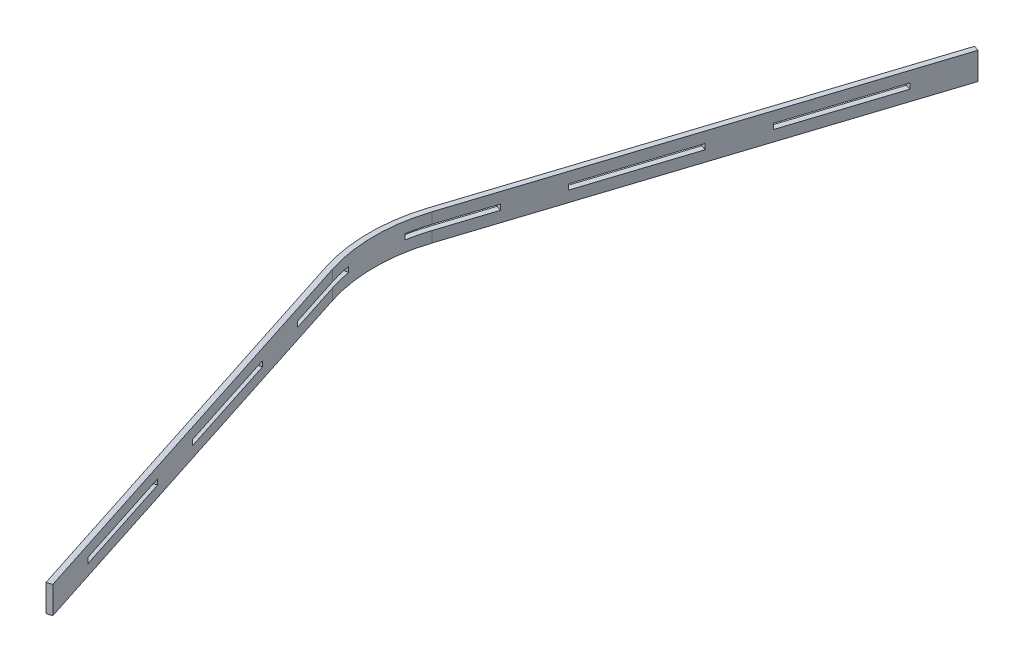
ISO-10303-21;
HEADER;
FILE_DESCRIPTION(('STEP AP214'),'2;1');
FILE_NAME('part.step','',(''),(''),'','','');
FILE_SCHEMA(('AUTOMOTIVE_DESIGN { 1 0 10303 214 1 1 1 1 }'));
ENDSEC;
DATA;
#1=APPLICATION_CONTEXT('core data for automotive mechanical design processes');
#2=APPLICATION_PROTOCOL_DEFINITION('international standard','automotive_design',2000,#1);
#3=PRODUCT_CONTEXT('',#1,'mechanical');
#4=PRODUCT('Part','Part','',(#3));
#5=PRODUCT_RELATED_PRODUCT_CATEGORY('part','',(#4));
#6=PRODUCT_DEFINITION_FORMATION('','',#4);
#7=PRODUCT_DEFINITION_CONTEXT('part definition',#1,'design');
#8=PRODUCT_DEFINITION('design','',#6,#7);
#9=PRODUCT_DEFINITION_SHAPE('','',#8);
#10=(LENGTH_UNIT() NAMED_UNIT(*) SI_UNIT(.MILLI.,.METRE.));
#11=(NAMED_UNIT(*) PLANE_ANGLE_UNIT() SI_UNIT($,.RADIAN.));
#12=(NAMED_UNIT(*) SI_UNIT($,.STERADIAN.) SOLID_ANGLE_UNIT());
#13=UNCERTAINTY_MEASURE_WITH_UNIT(LENGTH_MEASURE(1.E-05),#10,'distance_accuracy_value','');
#14=(GEOMETRIC_REPRESENTATION_CONTEXT(3) GLOBAL_UNCERTAINTY_ASSIGNED_CONTEXT((#13)) GLOBAL_UNIT_ASSIGNED_CONTEXT((#10,
#11,#12)) REPRESENTATION_CONTEXT('',''));
#15=CARTESIAN_POINT('',(0.,0.,0.));
#16=DIRECTION('',(0.,0.,1.));
#17=DIRECTION('',(1.,0.,0.));
#18=AXIS2_PLACEMENT_3D('',#15,#16,#17);
#19=CARTESIAN_POINT('',(0.,5.,0.));
#20=DIRECTION('',(0.,-1.,0.));
#21=DIRECTION('',(0.,0.,-1.));
#22=AXIS2_PLACEMENT_3D('',#19,#20,#21);
#23=PLANE('',#22);
#24=DIRECTION('',(0.306896026451273,0.,-0.951743047754182));
#25=VECTOR('',#24,1.);
#26=CARTESIAN_POINT('',(-40.0060931652364,5.,-853.463246138728));
#27=LINE('',#26,#25);
#28=CARTESIAN_POINT('',(-224.143709036,5.,-282.417417486219));
#29=VERTEX_POINT('',#28);
#30=CARTESIAN_POINT('',(-162.764503745746,5.,-472.766027037055));
#31=VERTEX_POINT('',#30);
#32=EDGE_CURVE('E551',#29,#31,#27,.T.);
#33=ORIENTED_EDGE('',*,*,#32,.F.);
#34=DIRECTION('',(-0.951743047754182,0.,-0.306896026451274));
#35=VECTOR('',#34,1.);
#36=CARTESIAN_POINT('',(-233.661139513542,5.,-285.486377750731));
#37=LINE('',#36,#35);
#38=CARTESIAN_POINT('',(-233.661139513542,5.,-285.486377750731));
#39=VERTEX_POINT('',#38);
#40=EDGE_CURVE('E573',#29,#39,#37,.T.);
#41=ORIENTED_EDGE('',*,*,#40,.T.);
#42=DIRECTION('',(-0.306896026451273,0.,0.951743047754182));
#43=VECTOR('',#42,1.);
#44=CARTESIAN_POINT('',(-49.5235236427783,5.,-856.532206403241));
#45=LINE('',#44,#43);
#46=CARTESIAN_POINT('',(-172.281934223287,5.,-475.834987301568));
#47=VERTEX_POINT('',#46);
#48=EDGE_CURVE('E553',#47,#39,#45,.T.);
#49=ORIENTED_EDGE('',*,*,#48,.F.);
#50=DIRECTION('',(0.951743047754182,0.,0.306896026451274));
#51=VECTOR('',#50,1.);
#52=CARTESIAN_POINT('',(-162.764503745746,5.,-472.766027037055));
#53=LINE('',#52,#51);
#54=EDGE_CURVE('E517',#47,#31,#53,.T.);
#55=ORIENTED_EDGE('',*,*,#54,.T.);
#56=EDGE_LOOP('',(#33,#41,#49,#55));
#57=FACE_BOUND('',#56,.T.);
#58=ADVANCED_FACE('F33',(#57),#23,.T.);
#59=CARTESIAN_POINT('',(-264.350742158669,5.,-190.312072975313));
#60=VERTEX_POINT('',#59);
#61=CARTESIAN_POINT('',(-295.040344803797,5.,-95.1377681998943));
#62=VERTEX_POINT('',#61);
#63=EDGE_CURVE('E550',#60,#62,#45,.T.);
#64=ORIENTED_EDGE('',*,*,#63,.F.);
#65=DIRECTION('',(0.951743047754183,0.,0.306896026451272));
#66=VECTOR('',#65,1.);
#67=CARTESIAN_POINT('',(-264.350742158669,5.,-190.312072975313));
#68=LINE('',#67,#66);
#69=CARTESIAN_POINT('',(-254.833311681128,5.,-187.2431127108));
#70=VERTEX_POINT('',#69);
#71=EDGE_CURVE('E50',#60,#70,#68,.T.);
#72=ORIENTED_EDGE('',*,*,#71,.T.);
#73=CARTESIAN_POINT('',(-285.522914326255,5.,-92.0688079353818));
#74=VERTEX_POINT('',#73);
#75=EDGE_CURVE('E543',#74,#70,#27,.T.);
#76=ORIENTED_EDGE('',*,*,#75,.F.);
#77=CARTESIAN_POINT('',(0.,5.,0.));
#78=DIRECTION('',(0.,-1.,0.));
#79=DIRECTION('',(0.,0.,-1.));
#80=AXIS2_PLACEMENT_3D('',#77,#78,#79);
#81=CIRCLE('',#80,300.);
#82=CARTESIAN_POINT('',(-295.442325903663,5.,-52.0944533000793));
#83=VERTEX_POINT('',#82);
#84=EDGE_CURVE('E533',#83,#74,#81,.T.);
#85=ORIENTED_EDGE('',*,*,#84,.F.);
#86=DIRECTION('',(-0.984807753012208,0.,-0.173648177666931));
#87=VECTOR('',#86,1.);
#88=CARTESIAN_POINT('',(-305.290403433784,5.,-53.8309350767487));
#89=LINE('',#88,#87);
#90=CARTESIAN_POINT('',(-305.290403433784,5.,-53.8309350767487));
#91=VERTEX_POINT('',#90);
#92=EDGE_CURVE('E348',#83,#91,#89,.T.);
#93=ORIENTED_EDGE('',*,*,#92,.T.);
#94=CARTESIAN_POINT('',(0.,5.,0.));
#95=DIRECTION('',(0.,1.,0.));
#96=DIRECTION('',(0.,0.,-1.));
#97=AXIS2_PLACEMENT_3D('',#94,#95,#96);
#98=CIRCLE('',#97,310.);
#99=EDGE_CURVE('E455',#62,#91,#98,.T.);
#100=ORIENTED_EDGE('',*,*,#99,.F.);
#101=EDGE_LOOP('',(#64,#72,#76,#85,#93,#100));
#102=FACE_BOUND('',#101,.T.);
#103=ADVANCED_FACE('F549',(#102),#23,.T.);
#104=CARTESIAN_POINT('',(-80.2131262879055,5.,-761.357901627822));
#105=VERTEX_POINT('',#104);
#106=CARTESIAN_POINT('',(-141.59233157816,5.,-571.009292076986));
#107=VERTEX_POINT('',#106);
#108=EDGE_CURVE('E554',#105,#107,#45,.T.);
#109=ORIENTED_EDGE('',*,*,#108,.F.);
#110=DIRECTION('',(0.951743047754182,0.,0.306896026451273));
#111=VECTOR('',#110,1.);
#112=CARTESIAN_POINT('',(-70.6956958103637,5.,-758.28894136331));
#113=LINE('',#112,#111);
#114=CARTESIAN_POINT('',(-70.6956958103637,5.,-758.28894136331));
#115=VERTEX_POINT('',#114);
#116=EDGE_CURVE('E58',#105,#115,#113,.T.);
#117=ORIENTED_EDGE('',*,*,#116,.T.);
#118=CARTESIAN_POINT('',(-132.074901100618,5.,-567.940331812473));
#119=VERTEX_POINT('',#118);
#120=EDGE_CURVE('E552',#119,#115,#27,.T.);
#121=ORIENTED_EDGE('',*,*,#120,.F.);
#122=DIRECTION('',(-0.951743047754185,0.,-0.306896026451265));
#123=VECTOR('',#122,1.);
#124=CARTESIAN_POINT('',(-132.074901100618,5.,-567.940331812473));
#125=LINE('',#124,#123);
#126=EDGE_CURVE('E595',#119,#107,#125,.T.);
#127=ORIENTED_EDGE('',*,*,#126,.T.);
#128=EDGE_LOOP('',(#109,#117,#121,#127));
#129=FACE_BOUND('',#128,.T.);
#130=ADVANCED_FACE('F609',(#129),#23,.T.);
#131=CARTESIAN_POINT('',(-305.290403433784,5.,53.8309350767487));
#132=VERTEX_POINT('',#131);
#133=CARTESIAN_POINT('',(-295.040344803796,5.,95.1377681998945));
#134=VERTEX_POINT('',#133);
#135=EDGE_CURVE('E477',#132,#134,#98,.T.);
#136=ORIENTED_EDGE('',*,*,#135,.F.);
#137=DIRECTION('',(0.984807753012208,0.,-0.173648177666931));
#138=VECTOR('',#137,1.);
#139=CARTESIAN_POINT('',(-305.290403433784,5.,53.8309350767487));
#140=LINE('',#139,#138);
#141=CARTESIAN_POINT('',(-295.442325903663,5.,52.0944533000794));
#142=VERTEX_POINT('',#141);
#143=EDGE_CURVE('E344',#132,#142,#140,.T.);
#144=ORIENTED_EDGE('',*,*,#143,.T.);
#145=CARTESIAN_POINT('',(-285.522914326255,5.,92.0688079353817));
#146=VERTEX_POINT('',#145);
#147=EDGE_CURVE('E436',#146,#142,#81,.T.);
#148=ORIENTED_EDGE('',*,*,#147,.F.);
#149=DIRECTION('',(-0.306896026451273,0.,-0.951743047754182));
#150=VECTOR('',#149,1.);
#151=CARTESIAN_POINT('',(-40.0060931652364,5.,853.463246138728));
#152=LINE('',#151,#150);
#153=CARTESIAN_POINT('',(-254.833311681127,5.,187.243112710801));
#154=VERTEX_POINT('',#153);
#155=EDGE_CURVE('E413',#154,#146,#152,.T.);
#156=ORIENTED_EDGE('',*,*,#155,.F.);
#157=DIRECTION('',(-0.951743047754183,0.,0.306896026451272));
#158=VECTOR('',#157,1.);
#159=CARTESIAN_POINT('',(-264.350742158669,5.,190.312072975313));
#160=LINE('',#159,#158);
#161=CARTESIAN_POINT('',(-264.350742158669,5.,190.312072975313));
#162=VERTEX_POINT('',#161);
#163=EDGE_CURVE('E368',#154,#162,#160,.T.);
#164=ORIENTED_EDGE('',*,*,#163,.T.);
#165=DIRECTION('',(0.306896026451273,0.,0.951743047754182));
#166=VECTOR('',#165,1.);
#167=CARTESIAN_POINT('',(-49.5235236427783,5.,856.532206403241));
#168=LINE('',#167,#166);
#169=EDGE_CURVE('E418',#134,#162,#168,.T.);
#170=ORIENTED_EDGE('',*,*,#169,.F.);
#171=EDGE_LOOP('',(#136,#144,#148,#156,#164,#170));
#172=FACE_BOUND('',#171,.T.);
#173=ADVANCED_FACE('F564',(#172),#23,.T.);
#174=CARTESIAN_POINT('',(-233.661139513542,5.,285.486377750731));
#175=VERTEX_POINT('',#174);
#176=CARTESIAN_POINT('',(-172.281934223287,5.,475.834987301568));
#177=VERTEX_POINT('',#176);
#178=EDGE_CURVE('E454',#175,#177,#168,.T.);
#179=ORIENTED_EDGE('',*,*,#178,.F.);
#180=DIRECTION('',(0.951743047754182,0.,-0.306896026451274));
#181=VECTOR('',#180,1.);
#182=CARTESIAN_POINT('',(-233.661139513542,5.,285.486377750731));
#183=LINE('',#182,#181);
#184=CARTESIAN_POINT('',(-224.143709036,5.,282.417417486219));
#185=VERTEX_POINT('',#184);
#186=EDGE_CURVE('E365',#175,#185,#183,.T.);
#187=ORIENTED_EDGE('',*,*,#186,.T.);
#188=CARTESIAN_POINT('',(-162.764503745746,5.,472.766027037055));
#189=VERTEX_POINT('',#188);
#190=EDGE_CURVE('E446',#189,#185,#152,.T.);
#191=ORIENTED_EDGE('',*,*,#190,.F.);
#192=DIRECTION('',(-0.951743047754182,0.,0.306896026451274));
#193=VECTOR('',#192,1.);
#194=CARTESIAN_POINT('',(-162.764503745746,5.,472.766027037055));
#195=LINE('',#194,#193);
#196=EDGE_CURVE('E390',#189,#177,#195,.T.);
#197=ORIENTED_EDGE('',*,*,#196,.T.);
#198=EDGE_LOOP('',(#179,#187,#191,#197));
#199=FACE_BOUND('',#198,.T.);
#200=ADVANCED_FACE('F616',(#199),#23,.T.);
#201=CARTESIAN_POINT('',(-141.59233157816,5.,571.009292076986));
#202=VERTEX_POINT('',#201);
#203=CARTESIAN_POINT('',(-80.2131262879055,5.,761.357901627822));
#204=VERTEX_POINT('',#203);
#205=EDGE_CURVE('E452',#202,#204,#168,.T.);
#206=ORIENTED_EDGE('',*,*,#205,.F.);
#207=DIRECTION('',(0.951743047754184,0.,-0.306896026451267));
#208=VECTOR('',#207,1.);
#209=CARTESIAN_POINT('',(-132.074901100618,5.,567.940331812473));
#210=LINE('',#209,#208);
#211=CARTESIAN_POINT('',(-132.074901100618,5.,567.940331812473));
#212=VERTEX_POINT('',#211);
#213=EDGE_CURVE('E393',#202,#212,#210,.T.);
#214=ORIENTED_EDGE('',*,*,#213,.T.);
#215=CARTESIAN_POINT('',(-70.6956958103637,5.,758.28894136331));
#216=VERTEX_POINT('',#215);
#217=EDGE_CURVE('E441',#216,#212,#152,.T.);
#218=ORIENTED_EDGE('',*,*,#217,.F.);
#219=DIRECTION('',(-0.951743047754182,0.,0.306896026451273));
#220=VECTOR('',#219,1.);
#221=CARTESIAN_POINT('',(-70.6956958103637,5.,758.28894136331));
#222=LINE('',#221,#220);
#223=EDGE_CURVE('E656',#216,#204,#222,.T.);
#224=ORIENTED_EDGE('',*,*,#223,.T.);
#225=EDGE_LOOP('',(#206,#214,#218,#224));
#226=FACE_BOUND('',#225,.T.);
#227=ADVANCED_FACE('F617',(#226),#23,.T.);
#228=CARTESIAN_POINT('',(-80.2131262879056,5.,761.357901627822));
#229=DIRECTION('',(0.951743047754182,0.,-0.306896026451273));
#230=DIRECTION('',(-0.306896026451273,0.,-0.951743047754182));
#231=AXIS2_PLACEMENT_3D('',#228,#229,#230);
#232=PLANE('',#231);
#233=DIRECTION('',(-0.306896026451273,0.,-0.951743047754182));
#234=VECTOR('',#233,1.);
#235=CARTESIAN_POINT('',(-295.040344803797,-25.,95.1377681998946));
#236=LINE('',#235,#234);
#237=CARTESIAN_POINT('',(-49.5235236427783,-25.,856.532206403241));
#238=VERTEX_POINT('',#237);
#239=CARTESIAN_POINT('',(-295.040344803797,-25.,95.1377681998944));
#240=VERTEX_POINT('',#239);
#241=EDGE_CURVE('E282',#238,#240,#236,.T.);
#242=ORIENTED_EDGE('',*,*,#241,.F.);
#243=DIRECTION('',(0.,-1.,0.));
#244=VECTOR('',#243,1.);
#245=CARTESIAN_POINT('',(-49.5235236427783,5.,856.532206403241));
#246=LINE('',#245,#244);
#247=CARTESIAN_POINT('',(-49.5235236427783,25.,856.532206403241));
#248=VERTEX_POINT('',#247);
#249=EDGE_CURVE('E11',#248,#238,#246,.T.);
#250=ORIENTED_EDGE('',*,*,#249,.F.);
#251=DIRECTION('',(0.306896026451273,0.,0.951743047754182));
#252=VECTOR('',#251,1.);
#253=CARTESIAN_POINT('',(-49.5235236427783,25.,856.532206403241));
#254=LINE('',#253,#252);
#255=CARTESIAN_POINT('',(-295.040344803796,25.,95.1377681998945));
#256=VERTEX_POINT('',#255);
#257=EDGE_CURVE('E430',#256,#248,#254,.T.);
#258=ORIENTED_EDGE('',*,*,#257,.F.);
#259=DIRECTION('',(0.,-1.,0.));
#260=VECTOR('',#259,1.);
#261=CARTESIAN_POINT('',(-295.040344803796,25.,95.1377681998945));
#262=LINE('',#261,#260);
#263=EDGE_CURVE('E433',#256,#134,#262,.T.);
#264=ORIENTED_EDGE('',*,*,#263,.T.);
#265=ORIENTED_EDGE('',*,*,#169,.T.);
#266=DIRECTION('',(0.,-1.,0.));
#267=VECTOR('',#266,1.);
#268=CARTESIAN_POINT('',(-264.350742158669,5.,190.312072975313));
#269=LINE('',#268,#267);
#270=CARTESIAN_POINT('',(-264.350742158669,-5.,190.312072975313));
#271=VERTEX_POINT('',#270);
#272=EDGE_CURVE('E372',#162,#271,#269,.T.);
#273=ORIENTED_EDGE('',*,*,#272,.T.);
#274=DIRECTION('',(-0.306896026451273,0.,-0.951743047754182));
#275=VECTOR('',#274,1.);
#276=CARTESIAN_POINT('',(-295.040344803797,-5.,95.1377681998946));
#277=LINE('',#276,#275);
#278=CARTESIAN_POINT('',(-295.040344803797,-5.,95.1377681998944));
#279=VERTEX_POINT('',#278);
#280=EDGE_CURVE('E295',#271,#279,#277,.T.);
#281=ORIENTED_EDGE('',*,*,#280,.T.);
#282=DIRECTION('',(0.,1.,0.));
#283=VECTOR('',#282,1.);
#284=CARTESIAN_POINT('',(-295.040344803797,-25.,95.1377681998944));
#285=LINE('',#284,#283);
#286=EDGE_CURVE('E275',#240,#279,#285,.T.);
#287=ORIENTED_EDGE('',*,*,#286,.F.);
#288=EDGE_LOOP('',(#242,#250,#258,#264,#265,#273,#281,#287));
#289=FACE_BOUND('',#288,.T.);
#290=CARTESIAN_POINT('',(-80.2131262879056,-5.,761.357901627822));
#291=VERTEX_POINT('',#290);
#292=CARTESIAN_POINT('',(-141.59233157816,-5.,571.009292076986));
#293=VERTEX_POINT('',#292);
#294=EDGE_CURVE('E485',#291,#293,#277,.T.);
#295=ORIENTED_EDGE('',*,*,#294,.T.);
#296=DIRECTION('',(0.,-1.,0.));
#297=VECTOR('',#296,1.);
#298=CARTESIAN_POINT('',(-141.59233157816,5.,571.009292076986));
#299=LINE('',#298,#297);
#300=EDGE_CURVE('E404',#202,#293,#299,.T.);
#301=ORIENTED_EDGE('',*,*,#300,.F.);
#302=ORIENTED_EDGE('',*,*,#205,.T.);
#303=DIRECTION('',(0.,-1.,0.));
#304=VECTOR('',#303,1.);
#305=CARTESIAN_POINT('',(-80.2131262879056,5.,761.357901627822));
#306=LINE('',#305,#304);
#307=EDGE_CURVE('E646',#204,#291,#306,.T.);
#308=ORIENTED_EDGE('',*,*,#307,.T.);
#309=EDGE_LOOP('',(#295,#301,#302,#308));
#310=FACE_BOUND('',#309,.T.);
#311=DIRECTION('',(0.,-1.,0.));
#312=VECTOR('',#311,1.);
#313=CARTESIAN_POINT('',(-172.281934223287,5.,475.834987301568));
#314=LINE('',#313,#312);
#315=CARTESIAN_POINT('',(-172.281934223287,-5.,475.834987301568));
#316=VERTEX_POINT('',#315);
#317=EDGE_CURVE('E407',#177,#316,#314,.T.);
#318=ORIENTED_EDGE('',*,*,#317,.T.);
#319=CARTESIAN_POINT('',(-233.661139513542,-5.,285.486377750731));
#320=VERTEX_POINT('',#319);
#321=EDGE_CURVE('E641',#316,#320,#277,.T.);
#322=ORIENTED_EDGE('',*,*,#321,.T.);
#323=DIRECTION('',(0.,-1.,0.));
#324=VECTOR('',#323,1.);
#325=CARTESIAN_POINT('',(-233.661139513542,5.,285.486377750731));
#326=LINE('',#325,#324);
#327=EDGE_CURVE('E386',#175,#320,#326,.T.);
#328=ORIENTED_EDGE('',*,*,#327,.F.);
#329=ORIENTED_EDGE('',*,*,#178,.T.);
#330=EDGE_LOOP('',(#318,#322,#328,#329));
#331=FACE_BOUND('',#330,.T.);
#332=ADVANCED_FACE('F35',(#289,#310,#331),#232,.F.);
#333=CARTESIAN_POINT('',(-49.5235236427783,5.,856.532206403241));
#334=DIRECTION('',(-0.306896026451275,0.,-0.951743047754182));
#335=DIRECTION('',(-0.951743047754182,0.,0.306896026451275));
#336=AXIS2_PLACEMENT_3D('',#333,#334,#335);
#337=PLANE('',#336);
#338=ORIENTED_EDGE('',*,*,#249,.T.);
#339=DIRECTION('',(-0.951743047754182,0.,0.306896026451275));
#340=VECTOR('',#339,1.);
#341=CARTESIAN_POINT('',(-49.5235236427783,-25.,856.532206403241));
#342=LINE('',#341,#340);
#343=CARTESIAN_POINT('',(-40.0060931652364,-25.,853.463246138728));
#344=VERTEX_POINT('',#343);
#345=EDGE_CURVE('E289',#344,#238,#342,.T.);
#346=ORIENTED_EDGE('',*,*,#345,.F.);
#347=DIRECTION('',(0.,-1.,0.));
#348=VECTOR('',#347,1.);
#349=CARTESIAN_POINT('',(-40.0060931652364,5.,853.463246138728));
#350=LINE('',#349,#348);
#351=CARTESIAN_POINT('',(-40.0060931652364,25.,853.463246138728));
#352=VERTEX_POINT('',#351);
#353=EDGE_CURVE('E42',#352,#344,#350,.T.);
#354=ORIENTED_EDGE('',*,*,#353,.F.);
#355=DIRECTION('',(0.951743047754182,0.,-0.306896026451275));
#356=VECTOR('',#355,1.);
#357=CARTESIAN_POINT('',(-49.5235236427783,25.,856.532206403241));
#358=LINE('',#357,#356);
#359=EDGE_CURVE('E414',#248,#352,#358,.T.);
#360=ORIENTED_EDGE('',*,*,#359,.F.);
#361=EDGE_LOOP('',(#338,#346,#354,#360));
#362=FACE_BOUND('',#361,.T.);
#363=ADVANCED_FACE('F677',(#362),#337,.F.);
#364=CARTESIAN_POINT('',(-70.6956958103637,5.,758.28894136331));
#365=DIRECTION('',(-0.951743047754182,0.,0.306896026451272));
#366=DIRECTION('',(0.306896026451272,0.,0.951743047754183));
#367=AXIS2_PLACEMENT_3D('',#364,#365,#366);
#368=PLANE('',#367);
#369=DIRECTION('',(0.306896026451273,0.,0.951743047754182));
#370=VECTOR('',#369,1.);
#371=CARTESIAN_POINT('',(-40.0060931652364,-5.,853.463246138728));
#372=LINE('',#371,#370);
#373=CARTESIAN_POINT('',(-132.074901100618,-5.,567.940331812473));
#374=VERTEX_POINT('',#373);
#375=CARTESIAN_POINT('',(-70.6956958103637,-5.,758.28894136331));
#376=VERTEX_POINT('',#375);
#377=EDGE_CURVE('E310',#374,#376,#372,.T.);
#378=ORIENTED_EDGE('',*,*,#377,.T.);
#379=DIRECTION('',(0.,-1.,0.));
#380=VECTOR('',#379,1.);
#381=CARTESIAN_POINT('',(-70.6956958103637,5.,758.28894136331));
#382=LINE('',#381,#380);
#383=EDGE_CURVE('E661',#216,#376,#382,.T.);
#384=ORIENTED_EDGE('',*,*,#383,.F.);
#385=ORIENTED_EDGE('',*,*,#217,.T.);
#386=DIRECTION('',(0.,-1.,0.));
#387=VECTOR('',#386,1.);
#388=CARTESIAN_POINT('',(-132.074901100618,5.,567.940331812473));
#389=LINE('',#388,#387);
#390=EDGE_CURVE('E397',#212,#374,#389,.T.);
#391=ORIENTED_EDGE('',*,*,#390,.T.);
#392=EDGE_LOOP('',(#378,#384,#385,#391));
#393=FACE_BOUND('',#392,.T.);
#394=CARTESIAN_POINT('',(-224.143709036,-5.,282.417417486218));
#395=VERTEX_POINT('',#394);
#396=CARTESIAN_POINT('',(-162.764503745746,-5.,472.766027037055));
#397=VERTEX_POINT('',#396);
#398=EDGE_CURVE('E320',#395,#397,#372,.T.);
#399=ORIENTED_EDGE('',*,*,#398,.T.);
#400=DIRECTION('',(0.,-1.,0.));
#401=VECTOR('',#400,1.);
#402=CARTESIAN_POINT('',(-162.764503745746,5.,472.766027037055));
#403=LINE('',#402,#401);
#404=EDGE_CURVE('E410',#189,#397,#403,.T.);
#405=ORIENTED_EDGE('',*,*,#404,.F.);
#406=ORIENTED_EDGE('',*,*,#190,.T.);
#407=DIRECTION('',(0.,-1.,0.));
#408=VECTOR('',#407,1.);
#409=CARTESIAN_POINT('',(-224.143709036,5.,282.417417486219));
#410=LINE('',#409,#408);
#411=EDGE_CURVE('E383',#185,#395,#410,.T.);
#412=ORIENTED_EDGE('',*,*,#411,.T.);
#413=EDGE_LOOP('',(#399,#405,#406,#412));
#414=FACE_BOUND('',#413,.T.);
#415=ORIENTED_EDGE('',*,*,#353,.T.);
#416=DIRECTION('',(0.306896026451273,0.,0.951743047754182));
#417=VECTOR('',#416,1.);
#418=CARTESIAN_POINT('',(-40.0060931652364,-25.,853.463246138728));
#419=LINE('',#418,#417);
#420=CARTESIAN_POINT('',(-285.522914326255,-25.,92.0688079353817));
#421=VERTEX_POINT('',#420);
#422=EDGE_CURVE('E673',#421,#344,#419,.T.);
#423=ORIENTED_EDGE('',*,*,#422,.F.);
#424=DIRECTION('',(0.,1.,0.));
#425=VECTOR('',#424,1.);
#426=CARTESIAN_POINT('',(-285.522914326255,-25.,92.0688079353817));
#427=LINE('',#426,#425);
#428=CARTESIAN_POINT('',(-285.522914326255,-5.,92.0688079353817));
#429=VERTEX_POINT('',#428);
#430=EDGE_CURVE('E321',#421,#429,#427,.T.);
#431=ORIENTED_EDGE('',*,*,#430,.T.);
#432=CARTESIAN_POINT('',(-254.833311681128,-5.,187.2431127108));
#433=VERTEX_POINT('',#432);
#434=EDGE_CURVE('E291',#429,#433,#372,.T.);
#435=ORIENTED_EDGE('',*,*,#434,.T.);
#436=DIRECTION('',(0.,-1.,0.));
#437=VECTOR('',#436,1.);
#438=CARTESIAN_POINT('',(-254.833311681128,5.,187.2431127108));
#439=LINE('',#438,#437);
#440=EDGE_CURVE('E380',#154,#433,#439,.T.);
#441=ORIENTED_EDGE('',*,*,#440,.F.);
#442=ORIENTED_EDGE('',*,*,#155,.T.);
#443=DIRECTION('',(0.,-1.,0.));
#444=VECTOR('',#443,1.);
#445=CARTESIAN_POINT('',(-285.522914326255,25.,92.0688079353817));
#446=LINE('',#445,#444);
#447=CARTESIAN_POINT('',(-285.522914326255,25.,92.0688079353817));
#448=VERTEX_POINT('',#447);
#449=EDGE_CURVE('E545',#448,#146,#446,.T.);
#450=ORIENTED_EDGE('',*,*,#449,.F.);
#451=DIRECTION('',(-0.306896026451273,0.,-0.951743047754182));
#452=VECTOR('',#451,1.);
#453=CARTESIAN_POINT('',(-40.0060931652364,25.,853.463246138728));
#454=LINE('',#453,#452);
#455=EDGE_CURVE('E417',#352,#448,#454,.T.);
#456=ORIENTED_EDGE('',*,*,#455,.F.);
#457=EDGE_LOOP('',(#415,#423,#431,#435,#441,#442,#450,#456));
#458=FACE_BOUND('',#457,.T.);
#459=ADVANCED_FACE('F672',(#393,#414,#458),#368,.F.);
#460=CARTESIAN_POINT('',(-70.6956958103637,5.,758.28894136331));
#461=DIRECTION('',(0.306896026451273,0.,0.951743047754182));
#462=DIRECTION('',(0.951743047754182,0.,-0.306896026451273));
#463=AXIS2_PLACEMENT_3D('',#460,#461,#462);
#464=PLANE('',#463);
#465=DIRECTION('',(-0.951743047754182,0.,0.306896026451273));
#466=VECTOR('',#465,1.);
#467=CARTESIAN_POINT('',(-70.6956958103637,-5.,758.28894136331));
#468=LINE('',#467,#466);
#469=EDGE_CURVE('E660',#376,#291,#468,.T.);
#470=ORIENTED_EDGE('',*,*,#469,.T.);
#471=ORIENTED_EDGE('',*,*,#307,.F.);
#472=ORIENTED_EDGE('',*,*,#223,.F.);
#473=ORIENTED_EDGE('',*,*,#383,.T.);
#474=EDGE_LOOP('',(#470,#471,#472,#473));
#475=FACE_BOUND('',#474,.T.);
#476=ADVANCED_FACE('F658',(#475),#464,.F.);
#477=CARTESIAN_POINT('',(0.,25.,0.));
#478=DIRECTION('',(0.,-1.,0.));
#479=DIRECTION('',(0.,0.,-1.));
#480=AXIS2_PLACEMENT_3D('',#477,#478,#479);
#481=CYLINDRICAL_SURFACE('',#480,300.);
#482=ORIENTED_EDGE('',*,*,#147,.T.);
#483=DIRECTION('',(0.,-1.,0.));
#484=VECTOR('',#483,1.);
#485=CARTESIAN_POINT('',(-295.442325903663,5.,52.0944533000794));
#486=LINE('',#485,#484);
#487=CARTESIAN_POINT('',(-295.442325903663,-5.,52.0944533000794));
#488=VERTEX_POINT('',#487);
#489=EDGE_CURVE('E466',#142,#488,#486,.T.);
#490=ORIENTED_EDGE('',*,*,#489,.T.);
#491=CARTESIAN_POINT('',(0.,-5.,0.));
#492=DIRECTION('',(0.,1.,0.));
#493=DIRECTION('',(0.,0.,1.));
#494=AXIS2_PLACEMENT_3D('',#491,#492,#493);
#495=CIRCLE('',#494,300.);
#496=EDGE_CURVE('E311',#488,#429,#495,.T.);
#497=ORIENTED_EDGE('',*,*,#496,.T.);
#498=ORIENTED_EDGE('',*,*,#430,.F.);
#499=CARTESIAN_POINT('',(0.,-25.,0.));
#500=DIRECTION('',(0.,1.,0.));
#501=DIRECTION('',(0.,0.,1.));
#502=AXIS2_PLACEMENT_3D('',#499,#500,#501);
#503=CIRCLE('',#502,300.);
#504=CARTESIAN_POINT('',(-285.522914326255,-25.,-92.0688079353817));
#505=VERTEX_POINT('',#504);
#506=EDGE_CURVE('E332',#505,#421,#503,.T.);
#507=ORIENTED_EDGE('',*,*,#506,.F.);
#508=DIRECTION('',(0.,1.,0.));
#509=VECTOR('',#508,1.);
#510=CARTESIAN_POINT('',(-285.522914326255,-25.,-92.0688079353817));
#511=LINE('',#510,#509);
#512=CARTESIAN_POINT('',(-285.522914326255,-5.,-92.0688079353817));
#513=VERTEX_POINT('',#512);
#514=EDGE_CURVE('E302',#505,#513,#511,.T.);
#515=ORIENTED_EDGE('',*,*,#514,.T.);
#516=CARTESIAN_POINT('',(-295.442325903662,-5.,-52.0944533000794));
#517=VERTEX_POINT('',#516);
#518=EDGE_CURVE('E306',#513,#517,#495,.T.);
#519=ORIENTED_EDGE('',*,*,#518,.T.);
#520=DIRECTION('',(0.,-1.,0.));
#521=VECTOR('',#520,1.);
#522=CARTESIAN_POINT('',(-295.442325903663,5.,-52.0944533000793));
#523=LINE('',#522,#521);
#524=EDGE_CURVE('E469',#83,#517,#523,.T.);
#525=ORIENTED_EDGE('',*,*,#524,.F.);
#526=ORIENTED_EDGE('',*,*,#84,.T.);
#527=DIRECTION('',(0.,-1.,0.));
#528=VECTOR('',#527,1.);
#529=CARTESIAN_POINT('',(-285.522914326255,25.,-92.0688079353818));
#530=LINE('',#529,#528);
#531=CARTESIAN_POINT('',(-285.522914326255,25.,-92.0688079353818));
#532=VERTEX_POINT('',#531);
#533=EDGE_CURVE('E536',#532,#74,#530,.T.);
#534=ORIENTED_EDGE('',*,*,#533,.F.);
#535=CARTESIAN_POINT('',(0.,25.,0.));
#536=DIRECTION('',(0.,-1.,0.));
#537=DIRECTION('',(0.,0.,-1.));
#538=AXIS2_PLACEMENT_3D('',#535,#536,#537);
#539=CIRCLE('',#538,300.);
#540=EDGE_CURVE('E420',#448,#532,#539,.T.);
#541=ORIENTED_EDGE('',*,*,#540,.F.);
#542=ORIENTED_EDGE('',*,*,#449,.T.);
#543=EDGE_LOOP('',(#482,#490,#497,#498,#507,#515,#519,#525,#526,#534,#541,#542));
#544=FACE_BOUND('',#543,.T.);
#545=ADVANCED_FACE('F329',(#544),#481,.F.);
#546=CARTESIAN_POINT('',(-40.0060931652364,25.,-853.463246138728));
#547=DIRECTION('',(-0.951743047754182,0.,-0.306896026451273));
#548=DIRECTION('',(-0.306896026451273,0.,0.951743047754182));
#549=AXIS2_PLACEMENT_3D('',#546,#547,#548);
#550=PLANE('',#549);
#551=DIRECTION('',(-0.306896026451273,0.,0.951743047754182));
#552=VECTOR('',#551,1.);
#553=CARTESIAN_POINT('',(-40.0060931652364,-5.,-853.463246138728));
#554=LINE('',#553,#552);
#555=CARTESIAN_POINT('',(-70.6956958103637,-5.,-758.28894136331));
#556=VERTEX_POINT('',#555);
#557=CARTESIAN_POINT('',(-132.074901100618,-5.,-567.940331812473));
#558=VERTEX_POINT('',#557);
#559=EDGE_CURVE('E496',#556,#558,#554,.T.);
#560=ORIENTED_EDGE('',*,*,#559,.T.);
#561=DIRECTION('',(0.,-1.,0.));
#562=VECTOR('',#561,1.);
#563=CARTESIAN_POINT('',(-132.074901100618,5.,-567.940331812473));
#564=LINE('',#563,#562);
#565=EDGE_CURVE('E522',#119,#558,#564,.T.);
#566=ORIENTED_EDGE('',*,*,#565,.F.);
#567=ORIENTED_EDGE('',*,*,#120,.T.);
#568=DIRECTION('',(0.,-1.,0.));
#569=VECTOR('',#568,1.);
#570=CARTESIAN_POINT('',(-70.6956958103637,5.,-758.28894136331));
#571=LINE('',#570,#569);
#572=EDGE_CURVE('E592',#115,#556,#571,.T.);
#573=ORIENTED_EDGE('',*,*,#572,.T.);
#574=EDGE_LOOP('',(#560,#566,#567,#573));
#575=FACE_BOUND('',#574,.T.);
#576=DIRECTION('',(-0.306896026451273,0.,0.951743047754182));
#577=VECTOR('',#576,1.);
#578=CARTESIAN_POINT('',(-40.0060931652364,-25.,-853.463246138728));
#579=LINE('',#578,#577);
#580=CARTESIAN_POINT('',(-40.0060931652364,-25.,-853.463246138728));
#581=VERTEX_POINT('',#580);
#582=EDGE_CURVE('E680',#581,#505,#579,.T.);
#583=ORIENTED_EDGE('',*,*,#582,.F.);
#584=DIRECTION('',(0.,-1.,0.));
#585=VECTOR('',#584,1.);
#586=CARTESIAN_POINT('',(-40.0060931652364,25.,-853.463246138728));
#587=LINE('',#586,#585);
#588=CARTESIAN_POINT('',(-40.0060931652364,25.,-853.463246138728));
#589=VERTEX_POINT('',#588);
#590=EDGE_CURVE('E546',#589,#581,#587,.T.);
#591=ORIENTED_EDGE('',*,*,#590,.F.);
#592=DIRECTION('',(0.306896026451273,0.,-0.951743047754182));
#593=VECTOR('',#592,1.);
#594=CARTESIAN_POINT('',(-40.0060931652364,25.,-853.463246138728));
#595=LINE('',#594,#593);
#596=EDGE_CURVE('E422',#532,#589,#595,.T.);
#597=ORIENTED_EDGE('',*,*,#596,.F.);
#598=ORIENTED_EDGE('',*,*,#533,.T.);
#599=ORIENTED_EDGE('',*,*,#75,.T.);
#600=DIRECTION('',(0.,-1.,0.));
#601=VECTOR('',#600,1.);
#602=CARTESIAN_POINT('',(-254.833311681128,5.,-187.2431127108));
#603=LINE('',#602,#601);
#604=CARTESIAN_POINT('',(-254.833311681127,-5.,-187.243112710801));
#605=VERTEX_POINT('',#604);
#606=EDGE_CURVE('E581',#70,#605,#603,.T.);
#607=ORIENTED_EDGE('',*,*,#606,.T.);
#608=EDGE_CURVE('E316',#605,#513,#554,.T.);
#609=ORIENTED_EDGE('',*,*,#608,.T.);
#610=ORIENTED_EDGE('',*,*,#514,.F.);
#611=EDGE_LOOP('',(#583,#591,#597,#598,#599,#607,#609,#610));
#612=FACE_BOUND('',#611,.T.);
#613=DIRECTION('',(0.,-1.,0.));
#614=VECTOR('',#613,1.);
#615=CARTESIAN_POINT('',(-162.764503745746,5.,-472.766027037055));
#616=LINE('',#615,#614);
#617=CARTESIAN_POINT('',(-162.764503745745,-5.,-472.766027037055));
#618=VERTEX_POINT('',#617);
#619=EDGE_CURVE('E518',#31,#618,#616,.T.);
#620=ORIENTED_EDGE('',*,*,#619,.T.);
#621=CARTESIAN_POINT('',(-224.143709036,-5.,-282.417417486219));
#622=VERTEX_POINT('',#621);
#623=EDGE_CURVE('E495',#618,#622,#554,.T.);
#624=ORIENTED_EDGE('',*,*,#623,.T.);
#625=DIRECTION('',(0.,-1.,0.));
#626=VECTOR('',#625,1.);
#627=CARTESIAN_POINT('',(-224.143709036,5.,-282.417417486219));
#628=LINE('',#627,#626);
#629=EDGE_CURVE('E576',#29,#622,#628,.T.);
#630=ORIENTED_EDGE('',*,*,#629,.F.);
#631=ORIENTED_EDGE('',*,*,#32,.T.);
#632=EDGE_LOOP('',(#620,#624,#630,#631));
#633=FACE_BOUND('',#632,.T.);
#634=ADVANCED_FACE('F540',(#575,#612,#633),#550,.F.);
#635=CARTESIAN_POINT('',(-49.5235236427783,25.,-856.532206403241));
#636=DIRECTION('',(-0.306896026451275,0.,0.951743047754182));
#637=DIRECTION('',(0.951743047754182,0.,0.306896026451275));
#638=AXIS2_PLACEMENT_3D('',#635,#636,#637);
#639=PLANE('',#638);
#640=ORIENTED_EDGE('',*,*,#590,.T.);
#641=DIRECTION('',(0.951743047754182,0.,0.306896026451275));
#642=VECTOR('',#641,1.);
#643=CARTESIAN_POINT('',(-49.5235236427783,-25.,-856.532206403241));
#644=LINE('',#643,#642);
#645=CARTESIAN_POINT('',(-49.5235236427783,-25.,-856.532206403241));
#646=VERTEX_POINT('',#645);
#647=EDGE_CURVE('E682',#646,#581,#644,.T.);
#648=ORIENTED_EDGE('',*,*,#647,.F.);
#649=DIRECTION('',(0.,-1.,0.));
#650=VECTOR('',#649,1.);
#651=CARTESIAN_POINT('',(-49.5235236427783,25.,-856.532206403241));
#652=LINE('',#651,#650);
#653=CARTESIAN_POINT('',(-49.5235236427783,25.,-856.532206403241));
#654=VERTEX_POINT('',#653);
#655=EDGE_CURVE('E690',#654,#646,#652,.T.);
#656=ORIENTED_EDGE('',*,*,#655,.F.);
#657=DIRECTION('',(-0.951743047754182,0.,-0.306896026451275));
#658=VECTOR('',#657,1.);
#659=CARTESIAN_POINT('',(-49.5235236427783,25.,-856.532206403241));
#660=LINE('',#659,#658);
#661=EDGE_CURVE('E424',#589,#654,#660,.T.);
#662=ORIENTED_EDGE('',*,*,#661,.F.);
#663=EDGE_LOOP('',(#640,#648,#656,#662));
#664=FACE_BOUND('',#663,.T.);
#665=ADVANCED_FACE('F688',(#664),#639,.F.);
#666=CARTESIAN_POINT('',(-49.5235236427783,25.,-856.532206403241));
#667=DIRECTION('',(0.951743047754182,0.,0.306896026451273));
#668=DIRECTION('',(0.306896026451273,0.,-0.951743047754182));
#669=AXIS2_PLACEMENT_3D('',#666,#667,#668);
#670=PLANE('',#669);
#671=DIRECTION('',(0.306896026451273,0.,-0.951743047754182));
#672=VECTOR('',#671,1.);
#673=CARTESIAN_POINT('',(-295.040344803797,-5.,-95.1377681998946));
#674=LINE('',#673,#672);
#675=CARTESIAN_POINT('',(-233.661139513542,-5.,-285.486377750731));
#676=VERTEX_POINT('',#675);
#677=CARTESIAN_POINT('',(-172.281934223287,-5.,-475.834987301568));
#678=VERTEX_POINT('',#677);
#679=EDGE_CURVE('E483',#676,#678,#674,.T.);
#680=ORIENTED_EDGE('',*,*,#679,.T.);
#681=DIRECTION('',(0.,-1.,0.));
#682=VECTOR('',#681,1.);
#683=CARTESIAN_POINT('',(-172.281934223287,5.,-475.834987301568));
#684=LINE('',#683,#682);
#685=EDGE_CURVE('E505',#47,#678,#684,.T.);
#686=ORIENTED_EDGE('',*,*,#685,.F.);
#687=ORIENTED_EDGE('',*,*,#48,.T.);
#688=DIRECTION('',(0.,-1.,0.));
#689=VECTOR('',#688,1.);
#690=CARTESIAN_POINT('',(-233.661139513542,5.,-285.486377750731));
#691=LINE('',#690,#689);
#692=EDGE_CURVE('E507',#39,#676,#691,.T.);
#693=ORIENTED_EDGE('',*,*,#692,.T.);
#694=EDGE_LOOP('',(#680,#686,#687,#693));
#695=FACE_BOUND('',#694,.T.);
#696=CARTESIAN_POINT('',(-141.59233157816,-5.,-571.009292076986));
#697=VERTEX_POINT('',#696);
#698=CARTESIAN_POINT('',(-80.2131262879057,-5.,-761.357901627822));
#699=VERTEX_POINT('',#698);
#700=EDGE_CURVE('E481',#697,#699,#674,.T.);
#701=ORIENTED_EDGE('',*,*,#700,.T.);
#702=DIRECTION('',(0.,-1.,0.));
#703=VECTOR('',#702,1.);
#704=CARTESIAN_POINT('',(-80.2131262879056,5.,-761.357901627822));
#705=LINE('',#704,#703);
#706=EDGE_CURVE('E588',#105,#699,#705,.T.);
#707=ORIENTED_EDGE('',*,*,#706,.F.);
#708=ORIENTED_EDGE('',*,*,#108,.T.);
#709=DIRECTION('',(0.,-1.,0.));
#710=VECTOR('',#709,1.);
#711=CARTESIAN_POINT('',(-141.59233157816,5.,-571.009292076986));
#712=LINE('',#711,#710);
#713=EDGE_CURVE('E351',#107,#697,#712,.T.);
#714=ORIENTED_EDGE('',*,*,#713,.T.);
#715=EDGE_LOOP('',(#701,#707,#708,#714));
#716=FACE_BOUND('',#715,.T.);
#717=ORIENTED_EDGE('',*,*,#655,.T.);
#718=DIRECTION('',(0.306896026451273,0.,-0.951743047754182));
#719=VECTOR('',#718,1.);
#720=CARTESIAN_POINT('',(-295.040344803797,-25.,-95.1377681998946));
#721=LINE('',#720,#719);
#722=CARTESIAN_POINT('',(-295.040344803797,-25.,-95.1377681998946));
#723=VERTEX_POINT('',#722);
#724=EDGE_CURVE('E281',#723,#646,#721,.T.);
#725=ORIENTED_EDGE('',*,*,#724,.F.);
#726=DIRECTION('',(0.,1.,0.));
#727=VECTOR('',#726,1.);
#728=CARTESIAN_POINT('',(-295.040344803797,-25.,-95.1377681998946));
#729=LINE('',#728,#727);
#730=CARTESIAN_POINT('',(-295.040344803797,-5.,-95.1377681998946));
#731=VERTEX_POINT('',#730);
#732=EDGE_CURVE('E277',#723,#731,#729,.T.);
#733=ORIENTED_EDGE('',*,*,#732,.T.);
#734=CARTESIAN_POINT('',(-264.350742158669,-5.,-190.312072975313));
#735=VERTEX_POINT('',#734);
#736=EDGE_CURVE('E484',#731,#735,#674,.T.);
#737=ORIENTED_EDGE('',*,*,#736,.T.);
#738=DIRECTION('',(0.,-1.,0.));
#739=VECTOR('',#738,1.);
#740=CARTESIAN_POINT('',(-264.350742158669,5.,-190.312072975313));
#741=LINE('',#740,#739);
#742=EDGE_CURVE('E583',#60,#735,#741,.T.);
#743=ORIENTED_EDGE('',*,*,#742,.F.);
#744=ORIENTED_EDGE('',*,*,#63,.T.);
#745=DIRECTION('',(0.,-1.,0.));
#746=VECTOR('',#745,1.);
#747=CARTESIAN_POINT('',(-295.040344803797,25.,-95.1377681998943));
#748=LINE('',#747,#746);
#749=CARTESIAN_POINT('',(-295.040344803797,25.,-95.1377681998943));
#750=VERTEX_POINT('',#749);
#751=EDGE_CURVE('E693',#750,#62,#748,.T.);
#752=ORIENTED_EDGE('',*,*,#751,.F.);
#753=DIRECTION('',(-0.306896026451273,0.,0.951743047754182));
#754=VECTOR('',#753,1.);
#755=CARTESIAN_POINT('',(-49.5235236427783,25.,-856.532206403241));
#756=LINE('',#755,#754);
#757=EDGE_CURVE('E426',#654,#750,#756,.T.);
#758=ORIENTED_EDGE('',*,*,#757,.F.);
#759=EDGE_LOOP('',(#717,#725,#733,#737,#743,#744,#752,#758));
#760=FACE_BOUND('',#759,.T.);
#761=ADVANCED_FACE('F502',(#695,#716,#760),#670,.F.);
#762=CARTESIAN_POINT('',(0.,25.,0.));
#763=DIRECTION('',(0.,-1.,0.));
#764=DIRECTION('',(0.,0.,-1.));
#765=AXIS2_PLACEMENT_3D('',#762,#763,#764);
#766=CYLINDRICAL_SURFACE('',#765,310.);
#767=ORIENTED_EDGE('',*,*,#99,.T.);
#768=DIRECTION('',(0.,-1.,0.));
#769=VECTOR('',#768,1.);
#770=CARTESIAN_POINT('',(-305.290403433784,5.,-53.8309350767487));
#771=LINE('',#770,#769);
#772=CARTESIAN_POINT('',(-305.290403433785,-5.,-53.8309350767487));
#773=VERTEX_POINT('',#772);
#774=EDGE_CURVE('E358',#91,#773,#771,.T.);
#775=ORIENTED_EDGE('',*,*,#774,.T.);
#776=CARTESIAN_POINT('',(0.,-5.,0.));
#777=DIRECTION('',(0.,-1.,0.));
#778=DIRECTION('',(0.,0.,1.));
#779=AXIS2_PLACEMENT_3D('',#776,#777,#778);
#780=CIRCLE('',#779,310.);
#781=EDGE_CURVE('E341',#773,#731,#780,.T.);
#782=ORIENTED_EDGE('',*,*,#781,.T.);
#783=ORIENTED_EDGE('',*,*,#732,.F.);
#784=CARTESIAN_POINT('',(0.,-25.,0.));
#785=DIRECTION('',(0.,-1.,0.));
#786=DIRECTION('',(0.,0.,1.));
#787=AXIS2_PLACEMENT_3D('',#784,#785,#786);
#788=CIRCLE('',#787,310.);
#789=EDGE_CURVE('E269',#240,#723,#788,.T.);
#790=ORIENTED_EDGE('',*,*,#789,.F.);
#791=ORIENTED_EDGE('',*,*,#286,.T.);
#792=CARTESIAN_POINT('',(-305.290403433785,-5.,53.8309350767487));
#793=VERTEX_POINT('',#792);
#794=EDGE_CURVE('E479',#279,#793,#780,.T.);
#795=ORIENTED_EDGE('',*,*,#794,.T.);
#796=DIRECTION('',(0.,-1.,0.));
#797=VECTOR('',#796,1.);
#798=CARTESIAN_POINT('',(-305.290403433784,5.,53.8309350767487));
#799=LINE('',#798,#797);
#800=EDGE_CURVE('E376',#132,#793,#799,.T.);
#801=ORIENTED_EDGE('',*,*,#800,.F.);
#802=ORIENTED_EDGE('',*,*,#135,.T.);
#803=ORIENTED_EDGE('',*,*,#263,.F.);
#804=CARTESIAN_POINT('',(0.,25.,0.));
#805=DIRECTION('',(0.,1.,0.));
#806=DIRECTION('',(0.,0.,-1.));
#807=AXIS2_PLACEMENT_3D('',#804,#805,#806);
#808=CIRCLE('',#807,310.);
#809=EDGE_CURVE('E428',#750,#256,#808,.T.);
#810=ORIENTED_EDGE('',*,*,#809,.F.);
#811=ORIENTED_EDGE('',*,*,#751,.T.);
#812=EDGE_LOOP('',(#767,#775,#782,#783,#790,#791,#795,#801,#802,#803,#810,#811));
#813=FACE_BOUND('',#812,.T.);
#814=ADVANCED_FACE('F272',(#813),#766,.T.);
#815=CARTESIAN_POINT('',(0.,25.,0.));
#816=DIRECTION('',(0.,-1.,0.));
#817=DIRECTION('',(0.,0.,-1.));
#818=AXIS2_PLACEMENT_3D('',#815,#816,#817);
#819=PLANE('',#818);
#820=ORIENTED_EDGE('',*,*,#359,.T.);
#821=ORIENTED_EDGE('',*,*,#455,.T.);
#822=ORIENTED_EDGE('',*,*,#540,.T.);
#823=ORIENTED_EDGE('',*,*,#596,.T.);
#824=ORIENTED_EDGE('',*,*,#661,.T.);
#825=ORIENTED_EDGE('',*,*,#757,.T.);
#826=ORIENTED_EDGE('',*,*,#809,.T.);
#827=ORIENTED_EDGE('',*,*,#257,.T.);
#828=EDGE_LOOP('',(#820,#821,#822,#823,#824,#825,#826,#827));
#829=FACE_BOUND('',#828,.T.);
#830=ADVANCED_FACE('F700',(#829),#819,.F.);
#831=CARTESIAN_POINT('',(-162.764503745746,5.,472.766027037055));
#832=DIRECTION('',(0.306896026451274,0.,0.951743047754182));
#833=DIRECTION('',(0.951743047754182,0.,-0.306896026451274));
#834=AXIS2_PLACEMENT_3D('',#831,#832,#833);
#835=PLANE('',#834);
#836=DIRECTION('',(-0.951743047754182,0.,0.306896026451274));
#837=VECTOR('',#836,1.);
#838=CARTESIAN_POINT('',(-162.764503745746,-5.,472.766027037055));
#839=LINE('',#838,#837);
#840=EDGE_CURVE('E389',#397,#316,#839,.T.);
#841=ORIENTED_EDGE('',*,*,#840,.T.);
#842=ORIENTED_EDGE('',*,*,#317,.F.);
#843=ORIENTED_EDGE('',*,*,#196,.F.);
#844=ORIENTED_EDGE('',*,*,#404,.T.);
#845=EDGE_LOOP('',(#841,#842,#843,#844));
#846=FACE_BOUND('',#845,.T.);
#847=ADVANCED_FACE('F636',(#846),#835,.F.);
#848=CARTESIAN_POINT('',(-132.074901100618,5.,567.940331812473));
#849=DIRECTION('',(-0.306896026451267,0.,-0.951743047754184));
#850=DIRECTION('',(-0.951743047754184,0.,0.306896026451267));
#851=AXIS2_PLACEMENT_3D('',#848,#849,#850);
#852=PLANE('',#851);
#853=DIRECTION('',(0.951743047754184,0.,-0.306896026451267));
#854=VECTOR('',#853,1.);
#855=CARTESIAN_POINT('',(-132.074901100618,-5.,567.940331812473));
#856=LINE('',#855,#854);
#857=EDGE_CURVE('E394',#293,#374,#856,.T.);
#858=ORIENTED_EDGE('',*,*,#857,.T.);
#859=ORIENTED_EDGE('',*,*,#390,.F.);
#860=ORIENTED_EDGE('',*,*,#213,.F.);
#861=ORIENTED_EDGE('',*,*,#300,.T.);
#862=EDGE_LOOP('',(#858,#859,#860,#861));
#863=FACE_BOUND('',#862,.T.);
#864=ADVANCED_FACE('F650',(#863),#852,.F.);
#865=CARTESIAN_POINT('',(-233.661139513542,5.,285.486377750731));
#866=DIRECTION('',(-0.306896026451274,0.,-0.951743047754182));
#867=DIRECTION('',(-0.951743047754182,0.,0.306896026451274));
#868=AXIS2_PLACEMENT_3D('',#865,#866,#867);
#869=PLANE('',#868);
#870=DIRECTION('',(0.951743047754182,0.,-0.306896026451274));
#871=VECTOR('',#870,1.);
#872=CARTESIAN_POINT('',(-233.661139513542,-5.,285.486377750731));
#873=LINE('',#872,#871);
#874=EDGE_CURVE('E373',#320,#395,#873,.T.);
#875=ORIENTED_EDGE('',*,*,#874,.T.);
#876=ORIENTED_EDGE('',*,*,#411,.F.);
#877=ORIENTED_EDGE('',*,*,#186,.F.);
#878=ORIENTED_EDGE('',*,*,#327,.T.);
#879=EDGE_LOOP('',(#875,#876,#877,#878));
#880=FACE_BOUND('',#879,.T.);
#881=ADVANCED_FACE('F729',(#880),#869,.F.);
#882=CARTESIAN_POINT('',(-264.350742158669,5.,190.312072975313));
#883=DIRECTION('',(0.306896026451272,0.,0.951743047754183));
#884=DIRECTION('',(0.951743047754182,0.,-0.306896026451272));
#885=AXIS2_PLACEMENT_3D('',#882,#883,#884);
#886=PLANE('',#885);
#887=DIRECTION('',(-0.951743047754183,0.,0.306896026451272));
#888=VECTOR('',#887,1.);
#889=CARTESIAN_POINT('',(-264.350742158669,-5.,190.312072975313));
#890=LINE('',#889,#888);
#891=EDGE_CURVE('E369',#433,#271,#890,.T.);
#892=ORIENTED_EDGE('',*,*,#891,.T.);
#893=ORIENTED_EDGE('',*,*,#272,.F.);
#894=ORIENTED_EDGE('',*,*,#163,.F.);
#895=ORIENTED_EDGE('',*,*,#440,.T.);
#896=EDGE_LOOP('',(#892,#893,#894,#895));
#897=FACE_BOUND('',#896,.T.);
#898=ADVANCED_FACE('F726',(#897),#886,.F.);
#899=CARTESIAN_POINT('',(-305.290403433784,5.,53.8309350767487));
#900=DIRECTION('',(-0.173648177666931,0.,-0.984807753012208));
#901=DIRECTION('',(-0.984807753012208,0.,0.173648177666931));
#902=AXIS2_PLACEMENT_3D('',#899,#900,#901);
#903=PLANE('',#902);
#904=DIRECTION('',(0.984807753012208,0.,-0.173648177666931));
#905=VECTOR('',#904,1.);
#906=CARTESIAN_POINT('',(-305.290403433784,-5.,53.8309350767487));
#907=LINE('',#906,#905);
#908=EDGE_CURVE('E345',#793,#488,#907,.T.);
#909=ORIENTED_EDGE('',*,*,#908,.T.);
#910=ORIENTED_EDGE('',*,*,#489,.F.);
#911=ORIENTED_EDGE('',*,*,#143,.F.);
#912=ORIENTED_EDGE('',*,*,#800,.T.);
#913=EDGE_LOOP('',(#909,#910,#911,#912));
#914=FACE_BOUND('',#913,.T.);
#915=ADVANCED_FACE('F474',(#914),#903,.F.);
#916=CARTESIAN_POINT('',(-305.290403433784,5.,-53.8309350767487));
#917=DIRECTION('',(-0.173648177666931,0.,0.984807753012208));
#918=DIRECTION('',(0.984807753012208,0.,0.173648177666931));
#919=AXIS2_PLACEMENT_3D('',#916,#917,#918);
#920=PLANE('',#919);
#921=DIRECTION('',(-0.984807753012208,0.,-0.173648177666931));
#922=VECTOR('',#921,1.);
#923=CARTESIAN_POINT('',(-305.290403433784,-5.,-53.8309350767487));
#924=LINE('',#923,#922);
#925=EDGE_CURVE('E339',#517,#773,#924,.T.);
#926=ORIENTED_EDGE('',*,*,#925,.T.);
#927=ORIENTED_EDGE('',*,*,#774,.F.);
#928=ORIENTED_EDGE('',*,*,#92,.F.);
#929=ORIENTED_EDGE('',*,*,#524,.T.);
#930=EDGE_LOOP('',(#926,#927,#928,#929));
#931=FACE_BOUND('',#930,.T.);
#932=ADVANCED_FACE('F531',(#931),#920,.F.);
#933=CARTESIAN_POINT('',(-132.074901100618,5.,-567.940331812473));
#934=DIRECTION('',(-0.306896026451265,0.,0.951743047754185));
#935=DIRECTION('',(0.951743047754185,0.,0.306896026451265));
#936=AXIS2_PLACEMENT_3D('',#933,#934,#935);
#937=PLANE('',#936);
#938=DIRECTION('',(-0.951743047754185,0.,-0.306896026451265));
#939=VECTOR('',#938,1.);
#940=CARTESIAN_POINT('',(-132.074901100618,-5.,-567.940331812473));
#941=LINE('',#940,#939);
#942=EDGE_CURVE('E594',#558,#697,#941,.T.);
#943=ORIENTED_EDGE('',*,*,#942,.T.);
#944=ORIENTED_EDGE('',*,*,#713,.F.);
#945=ORIENTED_EDGE('',*,*,#126,.F.);
#946=ORIENTED_EDGE('',*,*,#565,.T.);
#947=EDGE_LOOP('',(#943,#944,#945,#946));
#948=FACE_BOUND('',#947,.T.);
#949=ADVANCED_FACE('F604',(#948),#937,.F.);
#950=CARTESIAN_POINT('',(-162.764503745746,5.,-472.766027037055));
#951=DIRECTION('',(0.306896026451274,0.,-0.951743047754182));
#952=DIRECTION('',(-0.951743047754182,0.,-0.306896026451274));
#953=AXIS2_PLACEMENT_3D('',#950,#951,#952);
#954=PLANE('',#953);
#955=DIRECTION('',(0.951743047754182,0.,0.306896026451274));
#956=VECTOR('',#955,1.);
#957=CARTESIAN_POINT('',(-162.764503745746,-5.,-472.766027037055));
#958=LINE('',#957,#956);
#959=EDGE_CURVE('E514',#678,#618,#958,.T.);
#960=ORIENTED_EDGE('',*,*,#959,.T.);
#961=ORIENTED_EDGE('',*,*,#619,.F.);
#962=ORIENTED_EDGE('',*,*,#54,.F.);
#963=ORIENTED_EDGE('',*,*,#685,.T.);
#964=EDGE_LOOP('',(#960,#961,#962,#963));
#965=FACE_BOUND('',#964,.T.);
#966=ADVANCED_FACE('F512',(#965),#954,.F.);
#967=CARTESIAN_POINT('',(-70.6956958103637,5.,-758.28894136331));
#968=DIRECTION('',(0.306896026451273,0.,-0.951743047754182));
#969=DIRECTION('',(-0.951743047754182,0.,-0.306896026451273));
#970=AXIS2_PLACEMENT_3D('',#967,#968,#969);
#971=PLANE('',#970);
#972=DIRECTION('',(0.951743047754182,0.,0.306896026451273));
#973=VECTOR('',#972,1.);
#974=CARTESIAN_POINT('',(-70.6956958103637,-5.,-758.28894136331));
#975=LINE('',#974,#973);
#976=EDGE_CURVE('E586',#699,#556,#975,.T.);
#977=ORIENTED_EDGE('',*,*,#976,.T.);
#978=ORIENTED_EDGE('',*,*,#572,.F.);
#979=ORIENTED_EDGE('',*,*,#116,.F.);
#980=ORIENTED_EDGE('',*,*,#706,.T.);
#981=EDGE_LOOP('',(#977,#978,#979,#980));
#982=FACE_BOUND('',#981,.T.);
#983=ADVANCED_FACE('F712',(#982),#971,.F.);
#984=CARTESIAN_POINT('',(-233.661139513542,5.,-285.486377750731));
#985=DIRECTION('',(-0.306896026451274,0.,0.951743047754182));
#986=DIRECTION('',(0.951743047754182,0.,0.306896026451274));
#987=AXIS2_PLACEMENT_3D('',#984,#985,#986);
#988=PLANE('',#987);
#989=DIRECTION('',(-0.951743047754182,0.,-0.306896026451274));
#990=VECTOR('',#989,1.);
#991=CARTESIAN_POINT('',(-233.661139513542,-5.,-285.486377750731));
#992=LINE('',#991,#990);
#993=EDGE_CURVE('E297',#622,#676,#992,.T.);
#994=ORIENTED_EDGE('',*,*,#993,.T.);
#995=ORIENTED_EDGE('',*,*,#692,.F.);
#996=ORIENTED_EDGE('',*,*,#40,.F.);
#997=ORIENTED_EDGE('',*,*,#629,.T.);
#998=EDGE_LOOP('',(#994,#995,#996,#997));
#999=FACE_BOUND('',#998,.T.);
#1000=ADVANCED_FACE('F703',(#999),#988,.F.);
#1001=CARTESIAN_POINT('',(-264.350742158669,5.,-190.312072975313));
#1002=DIRECTION('',(0.306896026451272,0.,-0.951743047754183));
#1003=DIRECTION('',(-0.951743047754182,0.,-0.306896026451272));
#1004=AXIS2_PLACEMENT_3D('',#1001,#1002,#1003);
#1005=PLANE('',#1004);
#1006=DIRECTION('',(0.951743047754183,0.,0.306896026451272));
#1007=VECTOR('',#1006,1.);
#1008=CARTESIAN_POINT('',(-264.350742158669,-5.,-190.312072975313));
#1009=LINE('',#1008,#1007);
#1010=EDGE_CURVE('E300',#735,#605,#1009,.T.);
#1011=ORIENTED_EDGE('',*,*,#1010,.T.);
#1012=ORIENTED_EDGE('',*,*,#606,.F.);
#1013=ORIENTED_EDGE('',*,*,#71,.F.);
#1014=ORIENTED_EDGE('',*,*,#742,.T.);
#1015=EDGE_LOOP('',(#1011,#1012,#1013,#1014));
#1016=FACE_BOUND('',#1015,.T.);
#1017=ADVANCED_FACE('F701',(#1016),#1005,.F.);
#1018=CARTESIAN_POINT('',(0.,-5.,0.));
#1019=DIRECTION('',(0.,1.,0.));
#1020=DIRECTION('',(0.,0.,1.));
#1021=AXIS2_PLACEMENT_3D('',#1018,#1019,#1020);
#1022=PLANE('',#1021);
#1023=ORIENTED_EDGE('',*,*,#925,.F.);
#1024=ORIENTED_EDGE('',*,*,#518,.F.);
#1025=ORIENTED_EDGE('',*,*,#608,.F.);
#1026=ORIENTED_EDGE('',*,*,#1010,.F.);
#1027=ORIENTED_EDGE('',*,*,#736,.F.);
#1028=ORIENTED_EDGE('',*,*,#781,.F.);
#1029=EDGE_LOOP('',(#1023,#1024,#1025,#1026,#1027,#1028));
#1030=FACE_BOUND('',#1029,.T.);
#1031=ADVANCED_FACE('F336',(#1030),#1022,.T.);
#1032=ORIENTED_EDGE('',*,*,#908,.F.);
#1033=ORIENTED_EDGE('',*,*,#794,.F.);
#1034=ORIENTED_EDGE('',*,*,#280,.F.);
#1035=ORIENTED_EDGE('',*,*,#891,.F.);
#1036=ORIENTED_EDGE('',*,*,#434,.F.);
#1037=ORIENTED_EDGE('',*,*,#496,.F.);
#1038=EDGE_LOOP('',(#1032,#1033,#1034,#1035,#1036,#1037));
#1039=FACE_BOUND('',#1038,.T.);
#1040=ADVANCED_FACE('F709',(#1039),#1022,.T.);
#1041=ORIENTED_EDGE('',*,*,#469,.F.);
#1042=ORIENTED_EDGE('',*,*,#377,.F.);
#1043=ORIENTED_EDGE('',*,*,#857,.F.);
#1044=ORIENTED_EDGE('',*,*,#294,.F.);
#1045=EDGE_LOOP('',(#1041,#1042,#1043,#1044));
#1046=FACE_BOUND('',#1045,.T.);
#1047=ADVANCED_FACE('F857',(#1046),#1022,.T.);
#1048=ORIENTED_EDGE('',*,*,#840,.F.);
#1049=ORIENTED_EDGE('',*,*,#398,.F.);
#1050=ORIENTED_EDGE('',*,*,#874,.F.);
#1051=ORIENTED_EDGE('',*,*,#321,.F.);
#1052=EDGE_LOOP('',(#1048,#1049,#1050,#1051));
#1053=FACE_BOUND('',#1052,.T.);
#1054=ADVANCED_FACE('F640',(#1053),#1022,.T.);
#1055=ORIENTED_EDGE('',*,*,#942,.F.);
#1056=ORIENTED_EDGE('',*,*,#559,.F.);
#1057=ORIENTED_EDGE('',*,*,#976,.F.);
#1058=ORIENTED_EDGE('',*,*,#700,.F.);
#1059=EDGE_LOOP('',(#1055,#1056,#1057,#1058));
#1060=FACE_BOUND('',#1059,.T.);
#1061=ADVANCED_FACE('F607',(#1060),#1022,.T.);
#1062=ORIENTED_EDGE('',*,*,#959,.F.);
#1063=ORIENTED_EDGE('',*,*,#679,.F.);
#1064=ORIENTED_EDGE('',*,*,#993,.F.);
#1065=ORIENTED_EDGE('',*,*,#623,.F.);
#1066=EDGE_LOOP('',(#1062,#1063,#1064,#1065));
#1067=FACE_BOUND('',#1066,.T.);
#1068=ADVANCED_FACE('F711',(#1067),#1022,.T.);
#1069=CARTESIAN_POINT('',(0.,-25.,0.));
#1070=DIRECTION('',(0.,1.,0.));
#1071=DIRECTION('',(0.,0.,1.));
#1072=AXIS2_PLACEMENT_3D('',#1069,#1070,#1071);
#1073=PLANE('',#1072);
#1074=ORIENTED_EDGE('',*,*,#241,.T.);
#1075=ORIENTED_EDGE('',*,*,#789,.T.);
#1076=ORIENTED_EDGE('',*,*,#724,.T.);
#1077=ORIENTED_EDGE('',*,*,#647,.T.);
#1078=ORIENTED_EDGE('',*,*,#582,.T.);
#1079=ORIENTED_EDGE('',*,*,#506,.T.);
#1080=ORIENTED_EDGE('',*,*,#422,.T.);
#1081=ORIENTED_EDGE('',*,*,#345,.T.);
#1082=EDGE_LOOP('',(#1074,#1075,#1076,#1077,#1078,#1079,#1080,#1081));
#1083=FACE_BOUND('',#1082,.T.);
#1084=ADVANCED_FACE('F286',(#1083),#1073,.F.);
#1085=CLOSED_SHELL('',(#58,#103,#130,#173,#200,#227,#332,#363,#459,#476,#545,#634,#665,#761,
#814,#830,#847,#864,#881,#898,#915,#932,#949,#966,#983,#1000,#1017,#1031,#1040,#1047,#1054,
#1061,#1068,#1084));
#1086=MANIFOLD_SOLID_BREP('B2',#1085);
#1087=ADVANCED_BREP_SHAPE_REPRESENTATION('',(#18,#1086),#14);
#1088=SHAPE_DEFINITION_REPRESENTATION(#9,#1087);
ENDSEC;
END-ISO-10303-21;
